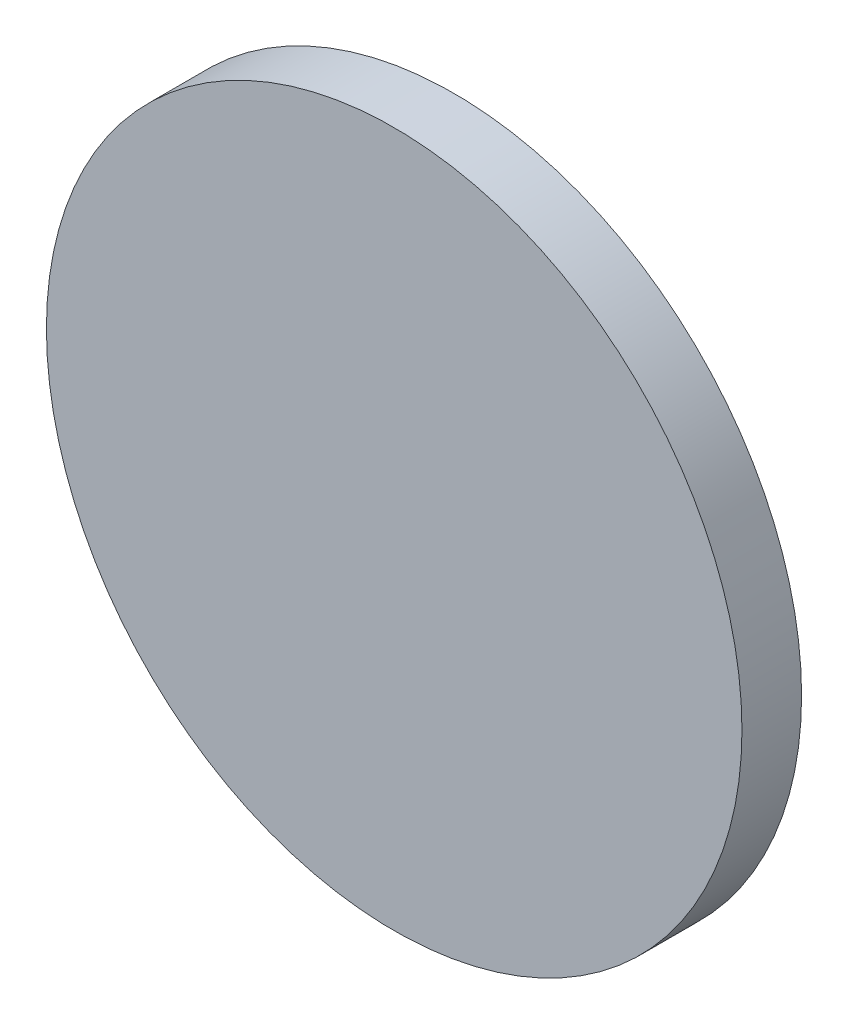
ISO-10303-21;
HEADER;
FILE_DESCRIPTION(('STEP AP214'),'2;1');
FILE_NAME('part.step','',(''),(''),'','','');
FILE_SCHEMA(('AUTOMOTIVE_DESIGN { 1 0 10303 214 1 1 1 1 }'));
ENDSEC;
DATA;
#1=APPLICATION_CONTEXT('core data for automotive mechanical design processes');
#2=APPLICATION_PROTOCOL_DEFINITION('international standard','automotive_design',2000,#1);
#3=PRODUCT_CONTEXT('',#1,'mechanical');
#4=PRODUCT('Part','Part','',(#3));
#5=PRODUCT_RELATED_PRODUCT_CATEGORY('part','',(#4));
#6=PRODUCT_DEFINITION_FORMATION('','',#4);
#7=PRODUCT_DEFINITION_CONTEXT('part definition',#1,'design');
#8=PRODUCT_DEFINITION('design','',#6,#7);
#9=PRODUCT_DEFINITION_SHAPE('','',#8);
#10=(LENGTH_UNIT() NAMED_UNIT(*) SI_UNIT(.MILLI.,.METRE.));
#11=(NAMED_UNIT(*) PLANE_ANGLE_UNIT() SI_UNIT($,.RADIAN.));
#12=(NAMED_UNIT(*) SI_UNIT($,.STERADIAN.) SOLID_ANGLE_UNIT());
#13=UNCERTAINTY_MEASURE_WITH_UNIT(LENGTH_MEASURE(1.E-05),#10,'distance_accuracy_value','');
#14=(GEOMETRIC_REPRESENTATION_CONTEXT(3) GLOBAL_UNCERTAINTY_ASSIGNED_CONTEXT((#13)) GLOBAL_UNIT_ASSIGNED_CONTEXT((#10,
#11,#12)) REPRESENTATION_CONTEXT('',''));
#15=CARTESIAN_POINT('',(0.,0.,0.));
#16=DIRECTION('',(0.,0.,1.));
#17=DIRECTION('',(1.,0.,0.));
#18=AXIS2_PLACEMENT_3D('',#15,#16,#17);
#19=CARTESIAN_POINT('',(1.651,8.477250006176,0.79916));
#20=DIRECTION('',(0.,0.,1.));
#21=DIRECTION('',(1.,0.,0.));
#22=AXIS2_PLACEMENT_3D('',#19,#20,#21);
#23=PLANE('',#22);
#24=CARTESIAN_POINT('',(1.651,8.477250006176,0.79916));
#25=DIRECTION('',(0.,0.,1.));
#26=DIRECTION('',(1.,0.,0.));
#27=AXIS2_PLACEMENT_3D('',#24,#25,#26);
#28=CIRCLE('',#27,0.200024667);
#29=CARTESIAN_POINT('',(1.851024667,8.477250006176,0.79916));
#30=VERTEX_POINT('',#29);
#31=EDGE_CURVE('E18',#30,#30,#28,.F.);
#32=ORIENTED_EDGE('',*,*,#31,.F.);
#33=EDGE_LOOP('',(#32));
#34=FACE_BOUND('',#33,.T.);
#35=ADVANCED_FACE('F15',(#34),#23,.T.);
#36=CARTESIAN_POINT('',(1.651,8.477250006176,0.76487));
#37=DIRECTION('',(0.,0.,1.));
#38=DIRECTION('',(1.,0.,0.));
#39=AXIS2_PLACEMENT_3D('',#36,#37,#38);
#40=CYLINDRICAL_SURFACE('',#39,0.200024667);
#41=ORIENTED_EDGE('',*,*,#31,.T.);
#42=EDGE_LOOP('',(#41));
#43=FACE_BOUND('',#42,.T.);
#44=CARTESIAN_POINT('',(1.651,8.477250006176,0.76487));
#45=DIRECTION('',(0.,0.,1.));
#46=DIRECTION('',(1.,0.,0.));
#47=AXIS2_PLACEMENT_3D('',#44,#45,#46);
#48=CIRCLE('',#47,0.200024667);
#49=CARTESIAN_POINT('',(1.851024667,8.477250006176,0.76487));
#50=VERTEX_POINT('',#49);
#51=EDGE_CURVE('E10',#50,#50,#48,.F.);
#52=ORIENTED_EDGE('',*,*,#51,.F.);
#53=EDGE_LOOP('',(#52));
#54=FACE_BOUND('',#53,.T.);
#55=ADVANCED_FACE('F27',(#43,#54),#40,.T.);
#56=CARTESIAN_POINT('',(1.651,8.477250006176,0.76487));
#57=DIRECTION('',(0.,0.,-1.));
#58=DIRECTION('',(-1.,0.,0.));
#59=AXIS2_PLACEMENT_3D('',#56,#57,#58);
#60=PLANE('',#59);
#61=ORIENTED_EDGE('',*,*,#51,.T.);
#62=EDGE_LOOP('',(#61));
#63=FACE_BOUND('',#62,.T.);
#64=ADVANCED_FACE('F35',(#63),#60,.T.);
#65=CLOSED_SHELL('',(#35,#55,#64));
#66=MANIFOLD_SOLID_BREP('B1',#65);
#67=ADVANCED_BREP_SHAPE_REPRESENTATION('',(#18,#66),#14);
#68=SHAPE_DEFINITION_REPRESENTATION(#9,#67);
ENDSEC;
END-ISO-10303-21;
